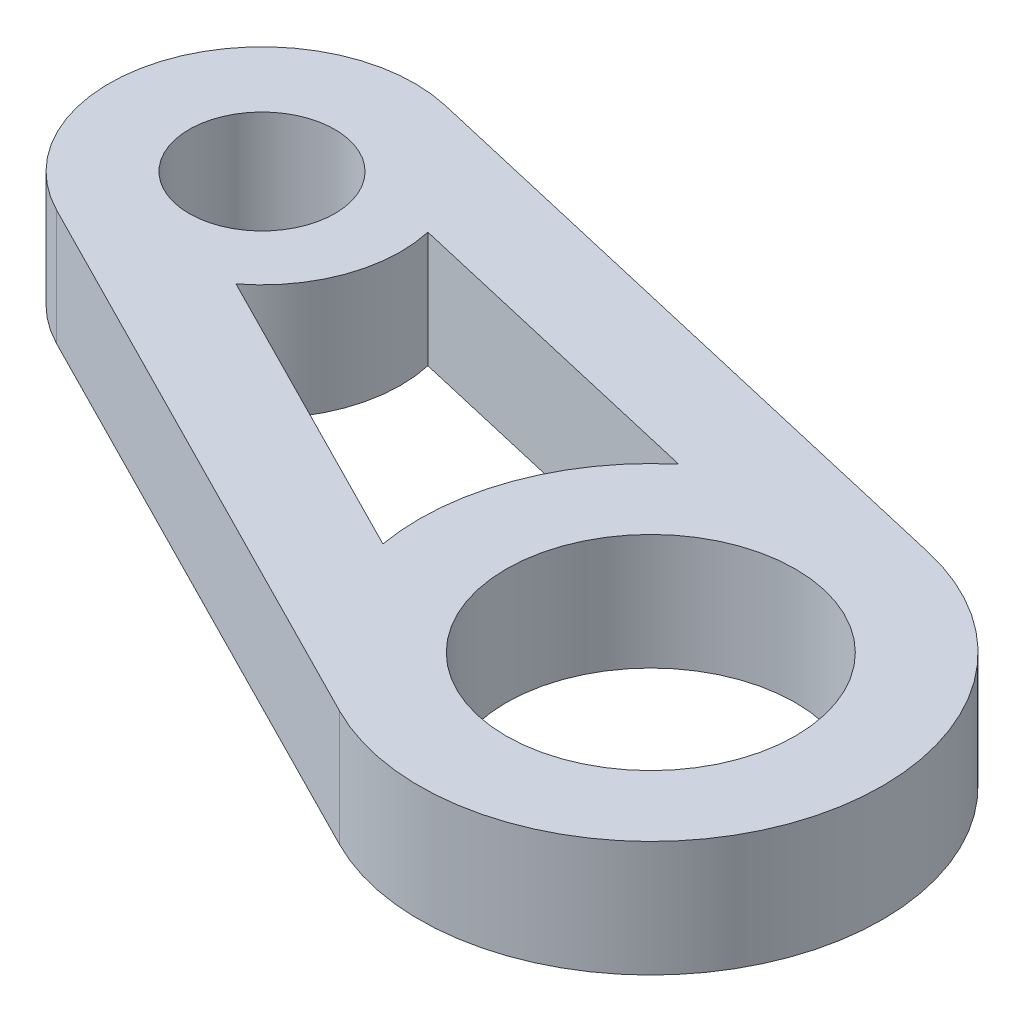
ISO-10303-21;
HEADER;
FILE_DESCRIPTION(('STEP AP214'),'2;1');
FILE_NAME('part.step','',(''),(''),'','','');
FILE_SCHEMA(('AUTOMOTIVE_DESIGN { 1 0 10303 214 1 1 1 1 }'));
ENDSEC;
DATA;
#1=APPLICATION_CONTEXT('core data for automotive mechanical design processes');
#2=APPLICATION_PROTOCOL_DEFINITION('international standard','automotive_design',2000,#1);
#3=PRODUCT_CONTEXT('',#1,'mechanical');
#4=PRODUCT('Part','Part','',(#3));
#5=PRODUCT_RELATED_PRODUCT_CATEGORY('part','',(#4));
#6=PRODUCT_DEFINITION_FORMATION('','',#4);
#7=PRODUCT_DEFINITION_CONTEXT('part definition',#1,'design');
#8=PRODUCT_DEFINITION('design','',#6,#7);
#9=PRODUCT_DEFINITION_SHAPE('','',#8);
#10=(LENGTH_UNIT() NAMED_UNIT(*) SI_UNIT(.MILLI.,.METRE.));
#11=(NAMED_UNIT(*) PLANE_ANGLE_UNIT() SI_UNIT($,.RADIAN.));
#12=(NAMED_UNIT(*) SI_UNIT($,.STERADIAN.) SOLID_ANGLE_UNIT());
#13=UNCERTAINTY_MEASURE_WITH_UNIT(LENGTH_MEASURE(1.E-05),#10,'distance_accuracy_value','');
#14=(GEOMETRIC_REPRESENTATION_CONTEXT(3) GLOBAL_UNCERTAINTY_ASSIGNED_CONTEXT((#13)) GLOBAL_UNIT_ASSIGNED_CONTEXT((#10,
#11,#12)) REPRESENTATION_CONTEXT('',''));
#15=CARTESIAN_POINT('',(0.,0.,0.));
#16=DIRECTION('',(0.,0.,1.));
#17=DIRECTION('',(1.,0.,0.));
#18=AXIS2_PLACEMENT_3D('',#15,#16,#17);
#19=CARTESIAN_POINT('',(16.764,3.175,6.096));
#20=DIRECTION('',(0.,-1.,0.));
#21=DIRECTION('',(0.,0.,-1.));
#22=AXIS2_PLACEMENT_3D('',#19,#20,#21);
#23=PLANE('',#22);
#24=CARTESIAN_POINT('',(16.764,3.175,6.096));
#25=DIRECTION('',(0.,1.,0.));
#26=DIRECTION('',(0.,0.,1.));
#27=AXIS2_PLACEMENT_3D('',#24,#25,#26);
#28=CIRCLE('',#27,3.96875);
#29=CARTESIAN_POINT('',(16.764,3.175,10.06475));
#30=VERTEX_POINT('',#29);
#31=EDGE_CURVE('E153',#30,#30,#28,.T.);
#32=ORIENTED_EDGE('',*,*,#31,.F.);
#33=EDGE_LOOP('',(#32));
#34=FACE_BOUND('',#33,.T.);
#35=CARTESIAN_POINT('',(0.,3.175,0.));
#36=DIRECTION('',(0.,1.,0.));
#37=DIRECTION('',(0.,0.,1.));
#38=AXIS2_PLACEMENT_3D('',#35,#36,#37);
#39=CIRCLE('',#38,2.);
#40=CARTESIAN_POINT('',(0.,3.175,2.));
#41=VERTEX_POINT('',#40);
#42=EDGE_CURVE('E161',#41,#41,#39,.T.);
#43=ORIENTED_EDGE('',*,*,#42,.F.);
#44=EDGE_LOOP('',(#43));
#45=FACE_BOUND('',#44,.T.);
#46=CARTESIAN_POINT('',(16.764,3.175,6.096));
#47=DIRECTION('',(0.,1.,0.));
#48=DIRECTION('',(0.,0.,-1.));
#49=AXIS2_PLACEMENT_3D('',#46,#47,#48);
#50=CIRCLE('',#49,6.35);
#51=CARTESIAN_POINT('',(13.8875919198479,3.175,11.757163887085));
#52=VERTEX_POINT('',#51);
#53=CARTESIAN_POINT('',(18.1958217054563,3.175,-0.0904680233380604));
#54=VERTEX_POINT('',#53);
#55=EDGE_CURVE('E169',#52,#54,#50,.T.);
#56=ORIENTED_EDGE('',*,*,#55,.T.);
#57=DIRECTION('',(-0.974246932809143,0.,-0.225483733142719));
#58=VECTOR('',#57,1.);
#59=CARTESIAN_POINT('',(18.1958217054563,3.175,-0.0904680233380604));
#60=LINE('',#59,#58);
#61=CARTESIAN_POINT('',(0.945002325601135,3.175,-4.08306889540312));
#62=VERTEX_POINT('',#61);
#63=EDGE_CURVE('E173',#54,#62,#60,.T.);
#64=ORIENTED_EDGE('',*,*,#63,.T.);
#65=CARTESIAN_POINT('',(0.,3.175,0.));
#66=DIRECTION('',(0.,1.,0.));
#67=DIRECTION('',(0.,0.,-1.));
#68=AXIS2_PLACEMENT_3D('',#65,#66,#67);
#69=CIRCLE('',#68,4.191);
#70=CARTESIAN_POINT('',(-1.8984293329004,3.175,3.73636816547611));
#71=VERTEX_POINT('',#70);
#72=EDGE_CURVE('E177',#62,#71,#69,.T.);
#73=ORIENTED_EDGE('',*,*,#72,.T.);
#74=DIRECTION('',(0.891521871981893,0.,0.452977650417658));
#75=VECTOR('',#74,1.);
#76=CARTESIAN_POINT('',(13.8875919198479,3.175,11.757163887085));
#77=LINE('',#76,#75);
#78=EDGE_CURVE('E180',#71,#52,#77,.T.);
#79=ORIENTED_EDGE('',*,*,#78,.T.);
#80=EDGE_LOOP('',(#56,#64,#73,#79));
#81=FACE_BOUND('',#80,.T.);
#82=CARTESIAN_POINT('',(16.764,3.175,6.096));
#83=DIRECTION('',(0.,-1.,0.));
#84=DIRECTION('',(0.,0.,1.));
#85=AXIS2_PLACEMENT_3D('',#82,#83,#84);
#86=CIRCLE('',#85,6.35);
#87=CARTESIAN_POINT('',(10.5092240422407,3.175,7.19157186812931));
#88=VERTEX_POINT('',#87);
#89=CARTESIAN_POINT('',(12.6739186046033,3.175,1.23866182163215));
#90=VERTEX_POINT('',#89);
#91=EDGE_CURVE('E105',#88,#90,#86,.T.);
#92=ORIENTED_EDGE('',*,*,#91,.F.);
#93=DIRECTION('',(0.891521871981893,0.,0.452977650417657));
#94=VECTOR('',#93,1.);
#95=CARTESIAN_POINT('',(10.5092240422407,3.175,7.19157186812931));
#96=LINE('',#95,#94);
#97=CARTESIAN_POINT('',(2.31335298068691,3.175,3.0272921872107));
#98=VERTEX_POINT('',#97);
#99=EDGE_CURVE('E131',#98,#88,#96,.T.);
#100=ORIENTED_EDGE('',*,*,#99,.F.);
#101=CARTESIAN_POINT('',(0.,3.175,0.));
#102=DIRECTION('',(0.,-1.,0.));
#103=DIRECTION('',(0.,0.,1.));
#104=AXIS2_PLACEMENT_3D('',#101,#102,#103);
#105=CIRCLE('',#104,3.81);
#106=CARTESIAN_POINT('',(3.71754580618006,3.175,-0.83423808289544));
#107=VERTEX_POINT('',#106);
#108=EDGE_CURVE('E127',#107,#98,#105,.T.);
#109=ORIENTED_EDGE('',*,*,#108,.F.);
#110=DIRECTION('',(-0.974246932809143,0.,-0.225483733142719));
#111=VECTOR('',#110,1.);
#112=CARTESIAN_POINT('',(12.6739186046033,3.175,1.23866182163215));
#113=LINE('',#112,#111);
#114=EDGE_CURVE('E114',#90,#107,#113,.T.);
#115=ORIENTED_EDGE('',*,*,#114,.F.);
#116=EDGE_LOOP('',(#92,#100,#109,#115));
#117=FACE_BOUND('',#116,.T.);
#118=ADVANCED_FACE('F39',(#34,#45,#81,#117),#23,.F.);
#119=CARTESIAN_POINT('',(16.764,0.,6.096));
#120=DIRECTION('',(0.,-1.,0.));
#121=DIRECTION('',(0.,0.,-1.));
#122=AXIS2_PLACEMENT_3D('',#119,#120,#121);
#123=PLANE('',#122);
#124=CARTESIAN_POINT('',(0.,0.,0.));
#125=DIRECTION('',(0.,1.,0.));
#126=DIRECTION('',(0.,0.,1.));
#127=AXIS2_PLACEMENT_3D('',#124,#125,#126);
#128=CIRCLE('',#127,2.);
#129=CARTESIAN_POINT('',(0.,0.,2.));
#130=VERTEX_POINT('',#129);
#131=EDGE_CURVE('E157',#130,#130,#128,.T.);
#132=ORIENTED_EDGE('',*,*,#131,.T.);
#133=EDGE_LOOP('',(#132));
#134=FACE_BOUND('',#133,.T.);
#135=CARTESIAN_POINT('',(16.764,0.,6.096));
#136=DIRECTION('',(0.,1.,0.));
#137=DIRECTION('',(0.,0.,-1.));
#138=AXIS2_PLACEMENT_3D('',#135,#136,#137);
#139=CIRCLE('',#138,6.35);
#140=CARTESIAN_POINT('',(13.8875919198479,0.,11.757163887085));
#141=VERTEX_POINT('',#140);
#142=CARTESIAN_POINT('',(18.1958217054563,0.,-0.0904680233380604));
#143=VERTEX_POINT('',#142);
#144=EDGE_CURVE('E165',#141,#143,#139,.T.);
#145=ORIENTED_EDGE('',*,*,#144,.F.);
#146=DIRECTION('',(0.891521871981893,0.,0.452977650417658));
#147=VECTOR('',#146,1.);
#148=CARTESIAN_POINT('',(13.8875919198479,0.,11.757163887085));
#149=LINE('',#148,#147);
#150=CARTESIAN_POINT('',(-1.8984293329004,0.,3.73636816547611));
#151=VERTEX_POINT('',#150);
#152=EDGE_CURVE('E174',#151,#141,#149,.T.);
#153=ORIENTED_EDGE('',*,*,#152,.F.);
#154=CARTESIAN_POINT('',(0.,0.,0.));
#155=DIRECTION('',(0.,1.,0.));
#156=DIRECTION('',(0.,0.,-1.));
#157=AXIS2_PLACEMENT_3D('',#154,#155,#156);
#158=CIRCLE('',#157,4.191);
#159=CARTESIAN_POINT('',(0.945002325601135,0.,-4.08306889540312));
#160=VERTEX_POINT('',#159);
#161=EDGE_CURVE('E190',#160,#151,#158,.T.);
#162=ORIENTED_EDGE('',*,*,#161,.F.);
#163=DIRECTION('',(-0.974246932809143,0.,-0.225483733142719));
#164=VECTOR('',#163,1.);
#165=CARTESIAN_POINT('',(18.1958217054563,0.,-0.0904680233380604));
#166=LINE('',#165,#164);
#167=EDGE_CURVE('E187',#143,#160,#166,.T.);
#168=ORIENTED_EDGE('',*,*,#167,.F.);
#169=EDGE_LOOP('',(#145,#153,#162,#168));
#170=FACE_BOUND('',#169,.T.);
#171=CARTESIAN_POINT('',(16.764,0.,6.096));
#172=DIRECTION('',(0.,1.,0.));
#173=DIRECTION('',(0.,0.,1.));
#174=AXIS2_PLACEMENT_3D('',#171,#172,#173);
#175=CIRCLE('',#174,3.96875);
#176=CARTESIAN_POINT('',(16.764,0.,10.06475));
#177=VERTEX_POINT('',#176);
#178=EDGE_CURVE('E123',#177,#177,#175,.T.);
#179=ORIENTED_EDGE('',*,*,#178,.T.);
#180=EDGE_LOOP('',(#179));
#181=FACE_BOUND('',#180,.T.);
#182=DIRECTION('',(0.891521871981893,0.,0.452977650417657));
#183=VECTOR('',#182,1.);
#184=CARTESIAN_POINT('',(10.5092240422407,0.,7.19157186812931));
#185=LINE('',#184,#183);
#186=CARTESIAN_POINT('',(2.31335298068691,0.,3.0272921872107));
#187=VERTEX_POINT('',#186);
#188=CARTESIAN_POINT('',(10.5092240422407,0.,7.19157186812931));
#189=VERTEX_POINT('',#188);
#190=EDGE_CURVE('E115',#187,#189,#185,.T.);
#191=ORIENTED_EDGE('',*,*,#190,.T.);
#192=CARTESIAN_POINT('',(16.764,0.,6.096));
#193=DIRECTION('',(0.,-1.,0.));
#194=DIRECTION('',(0.,0.,1.));
#195=AXIS2_PLACEMENT_3D('',#192,#193,#194);
#196=CIRCLE('',#195,6.35);
#197=CARTESIAN_POINT('',(12.6739186046033,0.,1.23866182163215));
#198=VERTEX_POINT('',#197);
#199=EDGE_CURVE('E63',#189,#198,#196,.T.);
#200=ORIENTED_EDGE('',*,*,#199,.T.);
#201=DIRECTION('',(-0.974246932809143,0.,-0.225483733142719));
#202=VECTOR('',#201,1.);
#203=CARTESIAN_POINT('',(12.6739186046033,0.,1.23866182163215));
#204=LINE('',#203,#202);
#205=CARTESIAN_POINT('',(3.71754580618006,0.,-0.83423808289544));
#206=VERTEX_POINT('',#205);
#207=EDGE_CURVE('E121',#198,#206,#204,.T.);
#208=ORIENTED_EDGE('',*,*,#207,.T.);
#209=CARTESIAN_POINT('',(0.,0.,0.));
#210=DIRECTION('',(0.,-1.,0.));
#211=DIRECTION('',(0.,0.,1.));
#212=AXIS2_PLACEMENT_3D('',#209,#210,#211);
#213=CIRCLE('',#212,3.81);
#214=EDGE_CURVE('E140',#206,#187,#213,.T.);
#215=ORIENTED_EDGE('',*,*,#214,.T.);
#216=EDGE_LOOP('',(#191,#200,#208,#215));
#217=FACE_BOUND('',#216,.T.);
#218=ADVANCED_FACE('F213',(#134,#170,#181,#217),#123,.T.);
#219=CARTESIAN_POINT('',(16.764,3.175,6.096));
#220=DIRECTION('',(0.,-1.,0.));
#221=DIRECTION('',(0.,0.,-1.));
#222=AXIS2_PLACEMENT_3D('',#219,#220,#221);
#223=CYLINDRICAL_SURFACE('',#222,6.35);
#224=ORIENTED_EDGE('',*,*,#144,.T.);
#225=DIRECTION('',(0.,-1.,0.));
#226=VECTOR('',#225,1.);
#227=CARTESIAN_POINT('',(18.1958217054563,3.175,-0.0904680233380604));
#228=LINE('',#227,#226);
#229=EDGE_CURVE('E11',#54,#143,#228,.T.);
#230=ORIENTED_EDGE('',*,*,#229,.F.);
#231=ORIENTED_EDGE('',*,*,#55,.F.);
#232=DIRECTION('',(0.,-1.,0.));
#233=VECTOR('',#232,1.);
#234=CARTESIAN_POINT('',(13.8875919198479,3.175,11.757163887085));
#235=LINE('',#234,#233);
#236=EDGE_CURVE('E183',#52,#141,#235,.T.);
#237=ORIENTED_EDGE('',*,*,#236,.T.);
#238=EDGE_LOOP('',(#224,#230,#231,#237));
#239=FACE_BOUND('',#238,.T.);
#240=ADVANCED_FACE('F41',(#239),#223,.T.);
#241=CARTESIAN_POINT('',(18.1958217054563,3.175,-0.0904680233380604));
#242=DIRECTION('',(-0.225483733142719,0.,0.974246932809143));
#243=DIRECTION('',(0.974246932809143,0.,0.225483733142719));
#244=AXIS2_PLACEMENT_3D('',#241,#242,#243);
#245=PLANE('',#244);
#246=ORIENTED_EDGE('',*,*,#167,.T.);
#247=DIRECTION('',(0.,-1.,0.));
#248=VECTOR('',#247,1.);
#249=CARTESIAN_POINT('',(0.945002325601135,3.175,-4.08306889540312));
#250=LINE('',#249,#248);
#251=EDGE_CURVE('E48',#62,#160,#250,.T.);
#252=ORIENTED_EDGE('',*,*,#251,.F.);
#253=ORIENTED_EDGE('',*,*,#63,.F.);
#254=ORIENTED_EDGE('',*,*,#229,.T.);
#255=EDGE_LOOP('',(#246,#252,#253,#254));
#256=FACE_BOUND('',#255,.T.);
#257=ADVANCED_FACE('F223',(#256),#245,.F.);
#258=CARTESIAN_POINT('',(0.,3.175,0.));
#259=DIRECTION('',(0.,-1.,0.));
#260=DIRECTION('',(0.,0.,-1.));
#261=AXIS2_PLACEMENT_3D('',#258,#259,#260);
#262=CYLINDRICAL_SURFACE('',#261,4.191);
#263=ORIENTED_EDGE('',*,*,#161,.T.);
#264=DIRECTION('',(0.,-1.,0.));
#265=VECTOR('',#264,1.);
#266=CARTESIAN_POINT('',(-1.8984293329004,3.175,3.73636816547611));
#267=LINE('',#266,#265);
#268=EDGE_CURVE('E198',#71,#151,#267,.T.);
#269=ORIENTED_EDGE('',*,*,#268,.F.);
#270=ORIENTED_EDGE('',*,*,#72,.F.);
#271=ORIENTED_EDGE('',*,*,#251,.T.);
#272=EDGE_LOOP('',(#263,#269,#270,#271));
#273=FACE_BOUND('',#272,.T.);
#274=ADVANCED_FACE('F207',(#273),#262,.T.);
#275=CARTESIAN_POINT('',(13.8875919198479,3.175,11.757163887085));
#276=DIRECTION('',(0.452977650417658,0.,-0.891521871981893));
#277=DIRECTION('',(-0.891521871981893,0.,-0.452977650417658));
#278=AXIS2_PLACEMENT_3D('',#275,#276,#277);
#279=PLANE('',#278);
#280=ORIENTED_EDGE('',*,*,#152,.T.);
#281=ORIENTED_EDGE('',*,*,#236,.F.);
#282=ORIENTED_EDGE('',*,*,#78,.F.);
#283=ORIENTED_EDGE('',*,*,#268,.T.);
#284=EDGE_LOOP('',(#280,#281,#282,#283));
#285=FACE_BOUND('',#284,.T.);
#286=ADVANCED_FACE('F217',(#285),#279,.F.);
#287=CARTESIAN_POINT('',(0.,3.175,0.));
#288=DIRECTION('',(0.,-1.,0.));
#289=DIRECTION('',(0.,0.,-1.));
#290=AXIS2_PLACEMENT_3D('',#287,#288,#289);
#291=CYLINDRICAL_SURFACE('',#290,2.);
#292=ORIENTED_EDGE('',*,*,#42,.T.);
#293=EDGE_LOOP('',(#292));
#294=FACE_BOUND('',#293,.T.);
#295=ORIENTED_EDGE('',*,*,#131,.F.);
#296=EDGE_LOOP('',(#295));
#297=FACE_BOUND('',#296,.T.);
#298=ADVANCED_FACE('F241',(#294,#297),#291,.F.);
#299=CARTESIAN_POINT('',(16.764,3.175,6.096));
#300=DIRECTION('',(0.,-1.,0.));
#301=DIRECTION('',(0.,0.,-1.));
#302=AXIS2_PLACEMENT_3D('',#299,#300,#301);
#303=CYLINDRICAL_SURFACE('',#302,3.96875);
#304=ORIENTED_EDGE('',*,*,#31,.T.);
#305=EDGE_LOOP('',(#304));
#306=FACE_BOUND('',#305,.T.);
#307=ORIENTED_EDGE('',*,*,#178,.F.);
#308=EDGE_LOOP('',(#307));
#309=FACE_BOUND('',#308,.T.);
#310=ADVANCED_FACE('F248',(#306,#309),#303,.F.);
#311=CARTESIAN_POINT('',(16.764,3.175,6.096));
#312=DIRECTION('',(0.,-1.,0.));
#313=DIRECTION('',(0.,0.,-1.));
#314=AXIS2_PLACEMENT_3D('',#311,#312,#313);
#315=CYLINDRICAL_SURFACE('',#314,6.35);
#316=ORIENTED_EDGE('',*,*,#199,.F.);
#317=DIRECTION('',(0.,-1.,0.));
#318=VECTOR('',#317,1.);
#319=CARTESIAN_POINT('',(10.5092240422407,3.175,7.19157186812931));
#320=LINE('',#319,#318);
#321=EDGE_CURVE('E109',#88,#189,#320,.T.);
#322=ORIENTED_EDGE('',*,*,#321,.F.);
#323=ORIENTED_EDGE('',*,*,#91,.T.);
#324=DIRECTION('',(0.,-1.,0.));
#325=VECTOR('',#324,1.);
#326=CARTESIAN_POINT('',(12.6739186046033,3.175,1.23866182163215));
#327=LINE('',#326,#325);
#328=EDGE_CURVE('E108',#90,#198,#327,.T.);
#329=ORIENTED_EDGE('',*,*,#328,.T.);
#330=EDGE_LOOP('',(#316,#322,#323,#329));
#331=FACE_BOUND('',#330,.T.);
#332=ADVANCED_FACE('F107',(#331),#315,.T.);
#333=CARTESIAN_POINT('',(12.6739186046033,3.175,1.23866182163215));
#334=DIRECTION('',(-0.225483733142719,0.,0.974246932809143));
#335=DIRECTION('',(0.974246932809143,0.,0.225483733142719));
#336=AXIS2_PLACEMENT_3D('',#333,#334,#335);
#337=PLANE('',#336);
#338=ORIENTED_EDGE('',*,*,#207,.F.);
#339=ORIENTED_EDGE('',*,*,#328,.F.);
#340=ORIENTED_EDGE('',*,*,#114,.T.);
#341=DIRECTION('',(0.,-1.,0.));
#342=VECTOR('',#341,1.);
#343=CARTESIAN_POINT('',(3.71754580618006,3.175,-0.83423808289544));
#344=LINE('',#343,#342);
#345=EDGE_CURVE('E124',#107,#206,#344,.T.);
#346=ORIENTED_EDGE('',*,*,#345,.T.);
#347=EDGE_LOOP('',(#338,#339,#340,#346));
#348=FACE_BOUND('',#347,.T.);
#349=ADVANCED_FACE('F118',(#348),#337,.T.);
#350=CARTESIAN_POINT('',(0.,3.175,0.));
#351=DIRECTION('',(0.,-1.,0.));
#352=DIRECTION('',(0.,0.,-1.));
#353=AXIS2_PLACEMENT_3D('',#350,#351,#352);
#354=CYLINDRICAL_SURFACE('',#353,3.81);
#355=ORIENTED_EDGE('',*,*,#214,.F.);
#356=ORIENTED_EDGE('',*,*,#345,.F.);
#357=ORIENTED_EDGE('',*,*,#108,.T.);
#358=DIRECTION('',(0.,-1.,0.));
#359=VECTOR('',#358,1.);
#360=CARTESIAN_POINT('',(2.31335298068691,3.175,3.0272921872107));
#361=LINE('',#360,#359);
#362=EDGE_CURVE('E55',#98,#187,#361,.T.);
#363=ORIENTED_EDGE('',*,*,#362,.T.);
#364=EDGE_LOOP('',(#355,#356,#357,#363));
#365=FACE_BOUND('',#364,.T.);
#366=ADVANCED_FACE('F265',(#365),#354,.T.);
#367=CARTESIAN_POINT('',(10.5092240422407,3.175,7.19157186812931));
#368=DIRECTION('',(0.452977650417657,0.,-0.891521871981893));
#369=DIRECTION('',(-0.891521871981893,0.,-0.452977650417658));
#370=AXIS2_PLACEMENT_3D('',#367,#368,#369);
#371=PLANE('',#370);
#372=ORIENTED_EDGE('',*,*,#190,.F.);
#373=ORIENTED_EDGE('',*,*,#362,.F.);
#374=ORIENTED_EDGE('',*,*,#99,.T.);
#375=ORIENTED_EDGE('',*,*,#321,.T.);
#376=EDGE_LOOP('',(#372,#373,#374,#375));
#377=FACE_BOUND('',#376,.T.);
#378=ADVANCED_FACE('F268',(#377),#371,.T.);
#379=CLOSED_SHELL('',(#118,#218,#240,#257,#274,#286,#298,#310,#332,#349,#366,#378));
#380=MANIFOLD_SOLID_BREP('B2',#379);
#381=ADVANCED_BREP_SHAPE_REPRESENTATION('',(#18,#380),#14);
#382=SHAPE_DEFINITION_REPRESENTATION(#9,#381);
ENDSEC;
END-ISO-10303-21;
